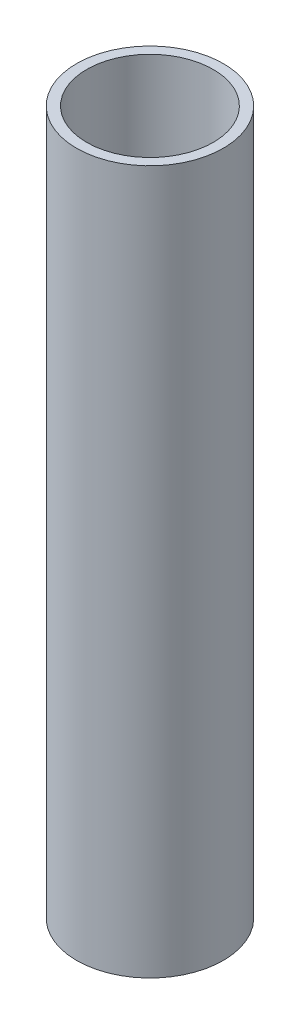
ISO-10303-21;
HEADER;
FILE_DESCRIPTION(('STEP AP214'),'2;1');
FILE_NAME('part.step','',(''),(''),'','','');
FILE_SCHEMA(('AUTOMOTIVE_DESIGN { 1 0 10303 214 1 1 1 1 }'));
ENDSEC;
DATA;
#1=APPLICATION_CONTEXT('core data for automotive mechanical design processes');
#2=APPLICATION_PROTOCOL_DEFINITION('international standard','automotive_design',2000,#1);
#3=PRODUCT_CONTEXT('',#1,'mechanical');
#4=PRODUCT('Part','Part','',(#3));
#5=PRODUCT_RELATED_PRODUCT_CATEGORY('part','',(#4));
#6=PRODUCT_DEFINITION_FORMATION('','',#4);
#7=PRODUCT_DEFINITION_CONTEXT('part definition',#1,'design');
#8=PRODUCT_DEFINITION('design','',#6,#7);
#9=PRODUCT_DEFINITION_SHAPE('','',#8);
#10=(LENGTH_UNIT() NAMED_UNIT(*) SI_UNIT(.MILLI.,.METRE.));
#11=(NAMED_UNIT(*) PLANE_ANGLE_UNIT() SI_UNIT($,.RADIAN.));
#12=(NAMED_UNIT(*) SI_UNIT($,.STERADIAN.) SOLID_ANGLE_UNIT());
#13=UNCERTAINTY_MEASURE_WITH_UNIT(LENGTH_MEASURE(1.E-05),#10,'distance_accuracy_value','');
#14=(GEOMETRIC_REPRESENTATION_CONTEXT(3) GLOBAL_UNCERTAINTY_ASSIGNED_CONTEXT((#13)) GLOBAL_UNIT_ASSIGNED_CONTEXT((#10,
#11,#12)) REPRESENTATION_CONTEXT('',''));
#15=CARTESIAN_POINT('',(0.,0.,0.));
#16=DIRECTION('',(0.,0.,1.));
#17=DIRECTION('',(1.,0.,0.));
#18=AXIS2_PLACEMENT_3D('',#15,#16,#17);
#19=CARTESIAN_POINT('',(0.,558.8,0.));
#20=DIRECTION('',(0.,1.,0.));
#21=DIRECTION('',(0.,0.,1.));
#22=AXIS2_PLACEMENT_3D('',#19,#20,#21);
#23=PLANE('',#22);
#24=CARTESIAN_POINT('',(0.,558.8,0.));
#25=DIRECTION('',(0.,1.,0.));
#26=DIRECTION('',(0.,0.,1.));
#27=AXIS2_PLACEMENT_3D('',#24,#25,#26);
#28=CIRCLE('',#27,58.293);
#29=CARTESIAN_POINT('',(0.,558.8,58.293));
#30=VERTEX_POINT('',#29);
#31=EDGE_CURVE('E10',#30,#30,#28,.T.);
#32=ORIENTED_EDGE('',*,*,#31,.T.);
#33=EDGE_LOOP('',(#32));
#34=FACE_BOUND('',#33,.T.);
#35=CARTESIAN_POINT('',(0.,558.8,0.));
#36=DIRECTION('',(0.,1.,0.));
#37=DIRECTION('',(0.,0.,1.));
#38=AXIS2_PLACEMENT_3D('',#35,#36,#37);
#39=CIRCLE('',#38,50.2539);
#40=CARTESIAN_POINT('',(0.,558.8,50.2539));
#41=VERTEX_POINT('',#40);
#42=EDGE_CURVE('E54',#41,#41,#39,.T.);
#43=ORIENTED_EDGE('',*,*,#42,.F.);
#44=EDGE_LOOP('',(#43));
#45=FACE_BOUND('',#44,.T.);
#46=ADVANCED_FACE('F41',(#34,#45),#23,.T.);
#47=CARTESIAN_POINT('',(0.,0.,0.));
#48=DIRECTION('',(0.,1.,0.));
#49=DIRECTION('',(0.,0.,1.));
#50=AXIS2_PLACEMENT_3D('',#47,#48,#49);
#51=PLANE('',#50);
#52=CARTESIAN_POINT('',(0.,0.,0.));
#53=DIRECTION('',(0.,1.,0.));
#54=DIRECTION('',(0.,0.,1.));
#55=AXIS2_PLACEMENT_3D('',#52,#53,#54);
#56=CIRCLE('',#55,58.293);
#57=CARTESIAN_POINT('',(0.,0.,58.293));
#58=VERTEX_POINT('',#57);
#59=EDGE_CURVE('E45',#58,#58,#56,.T.);
#60=ORIENTED_EDGE('',*,*,#59,.F.);
#61=EDGE_LOOP('',(#60));
#62=FACE_BOUND('',#61,.T.);
#63=CARTESIAN_POINT('',(0.,0.,0.));
#64=DIRECTION('',(0.,1.,0.));
#65=DIRECTION('',(0.,0.,1.));
#66=AXIS2_PLACEMENT_3D('',#63,#64,#65);
#67=CIRCLE('',#66,50.2539);
#68=CARTESIAN_POINT('',(0.,0.,50.2539));
#69=VERTEX_POINT('',#68);
#70=EDGE_CURVE('E56',#69,#69,#67,.T.);
#71=ORIENTED_EDGE('',*,*,#70,.T.);
#72=EDGE_LOOP('',(#71));
#73=FACE_BOUND('',#72,.T.);
#74=ADVANCED_FACE('F68',(#62,#73),#51,.F.);
#75=CARTESIAN_POINT('',(0.,558.8,0.));
#76=DIRECTION('',(0.,-1.,0.));
#77=DIRECTION('',(0.,0.,-1.));
#78=AXIS2_PLACEMENT_3D('',#75,#76,#77);
#79=CYLINDRICAL_SURFACE('',#78,58.293);
#80=ORIENTED_EDGE('',*,*,#31,.F.);
#81=EDGE_LOOP('',(#80));
#82=FACE_BOUND('',#81,.T.);
#83=ORIENTED_EDGE('',*,*,#59,.T.);
#84=EDGE_LOOP('',(#83));
#85=FACE_BOUND('',#84,.T.);
#86=ADVANCED_FACE('F43',(#82,#85),#79,.T.);
#87=CARTESIAN_POINT('',(0.,558.8,0.));
#88=DIRECTION('',(0.,-1.,0.));
#89=DIRECTION('',(0.,0.,-1.));
#90=AXIS2_PLACEMENT_3D('',#87,#88,#89);
#91=CYLINDRICAL_SURFACE('',#90,50.2539);
#92=ORIENTED_EDGE('',*,*,#42,.T.);
#93=EDGE_LOOP('',(#92));
#94=FACE_BOUND('',#93,.T.);
#95=ORIENTED_EDGE('',*,*,#70,.F.);
#96=EDGE_LOOP('',(#95));
#97=FACE_BOUND('',#96,.T.);
#98=ADVANCED_FACE('F64',(#94,#97),#91,.F.);
#99=CLOSED_SHELL('',(#46,#74,#86,#98));
#100=MANIFOLD_SOLID_BREP('B2',#99);
#101=ADVANCED_BREP_SHAPE_REPRESENTATION('',(#18,#100),#14);
#102=SHAPE_DEFINITION_REPRESENTATION(#9,#101);
ENDSEC;
END-ISO-10303-21;
